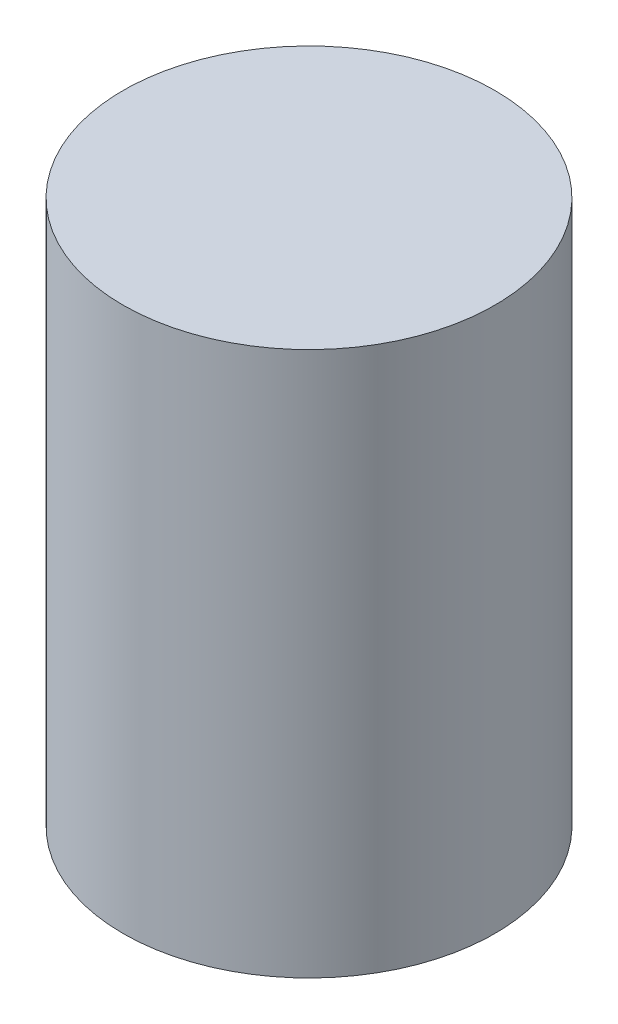
ISO-10303-21;
HEADER;
FILE_DESCRIPTION(('STEP AP214'),'2;1');
FILE_NAME('part.step','',(''),(''),'','','');
FILE_SCHEMA(('AUTOMOTIVE_DESIGN { 1 0 10303 214 1 1 1 1 }'));
ENDSEC;
DATA;
#1=APPLICATION_CONTEXT('core data for automotive mechanical design processes');
#2=APPLICATION_PROTOCOL_DEFINITION('international standard','automotive_design',2000,#1);
#3=PRODUCT_CONTEXT('',#1,'mechanical');
#4=PRODUCT('Part','Part','',(#3));
#5=PRODUCT_RELATED_PRODUCT_CATEGORY('part','',(#4));
#6=PRODUCT_DEFINITION_FORMATION('','',#4);
#7=PRODUCT_DEFINITION_CONTEXT('part definition',#1,'design');
#8=PRODUCT_DEFINITION('design','',#6,#7);
#9=PRODUCT_DEFINITION_SHAPE('','',#8);
#10=(LENGTH_UNIT() NAMED_UNIT(*) SI_UNIT(.MILLI.,.METRE.));
#11=(NAMED_UNIT(*) PLANE_ANGLE_UNIT() SI_UNIT($,.RADIAN.));
#12=(NAMED_UNIT(*) SI_UNIT($,.STERADIAN.) SOLID_ANGLE_UNIT());
#13=UNCERTAINTY_MEASURE_WITH_UNIT(LENGTH_MEASURE(1.E-05),#10,'distance_accuracy_value','');
#14=(GEOMETRIC_REPRESENTATION_CONTEXT(3) GLOBAL_UNCERTAINTY_ASSIGNED_CONTEXT((#13)) GLOBAL_UNIT_ASSIGNED_CONTEXT((#10,
#11,#12)) REPRESENTATION_CONTEXT('',''));
#15=CARTESIAN_POINT('',(0.,0.,0.));
#16=DIRECTION('',(0.,0.,1.));
#17=DIRECTION('',(1.,0.,0.));
#18=AXIS2_PLACEMENT_3D('',#15,#16,#17);
#19=CARTESIAN_POINT('',(2.60088099641421,60.,-13.7889754663857));
#20=DIRECTION('',(0.,-1.,0.));
#21=DIRECTION('',(0.,0.,-1.));
#22=AXIS2_PLACEMENT_3D('',#19,#20,#21);
#23=CYLINDRICAL_SURFACE('',#22,20.5);
#24=CARTESIAN_POINT('',(2.60088099641421,60.,-13.7889754663857));
#25=DIRECTION('',(0.,1.,0.));
#26=DIRECTION('',(0.,0.,1.));
#27=AXIS2_PLACEMENT_3D('',#24,#25,#26);
#28=CIRCLE('',#27,20.5);
#29=CARTESIAN_POINT('',(2.60088099641421,60.,6.71102453361435));
#30=VERTEX_POINT('',#29);
#31=EDGE_CURVE('E10',#30,#30,#28,.T.);
#32=ORIENTED_EDGE('',*,*,#31,.F.);
#33=EDGE_LOOP('',(#32));
#34=FACE_BOUND('',#33,.T.);
#35=CARTESIAN_POINT('',(2.60088099641421,0.,-13.7889754663857));
#36=DIRECTION('',(0.,1.,0.));
#37=DIRECTION('',(0.,0.,1.));
#38=AXIS2_PLACEMENT_3D('',#35,#36,#37);
#39=CIRCLE('',#38,20.5);
#40=CARTESIAN_POINT('',(2.60088099641421,0.,6.71102453361435));
#41=VERTEX_POINT('',#40);
#42=EDGE_CURVE('E46',#41,#41,#39,.T.);
#43=ORIENTED_EDGE('',*,*,#42,.T.);
#44=EDGE_LOOP('',(#43));
#45=FACE_BOUND('',#44,.T.);
#46=ADVANCED_FACE('F43',(#34,#45),#23,.T.);
#47=CARTESIAN_POINT('',(0.,60.,0.));
#48=DIRECTION('',(0.,1.,0.));
#49=DIRECTION('',(0.,0.,1.));
#50=AXIS2_PLACEMENT_3D('',#47,#48,#49);
#51=PLANE('',#50);
#52=ORIENTED_EDGE('',*,*,#31,.T.);
#53=EDGE_LOOP('',(#52));
#54=FACE_BOUND('',#53,.T.);
#55=ADVANCED_FACE('F60',(#54),#51,.T.);
#56=CARTESIAN_POINT('',(0.,0.,0.));
#57=DIRECTION('',(0.,1.,0.));
#58=DIRECTION('',(0.,0.,1.));
#59=AXIS2_PLACEMENT_3D('',#56,#57,#58);
#60=PLANE('',#59);
#61=ORIENTED_EDGE('',*,*,#42,.F.);
#62=EDGE_LOOP('',(#61));
#63=FACE_BOUND('',#62,.T.);
#64=ADVANCED_FACE('F58',(#63),#60,.F.);
#65=CLOSED_SHELL('',(#46,#55,#64));
#66=MANIFOLD_SOLID_BREP('B2',#65);
#67=ADVANCED_BREP_SHAPE_REPRESENTATION('',(#18,#66),#14);
#68=SHAPE_DEFINITION_REPRESENTATION(#9,#67);
ENDSEC;
END-ISO-10303-21;
